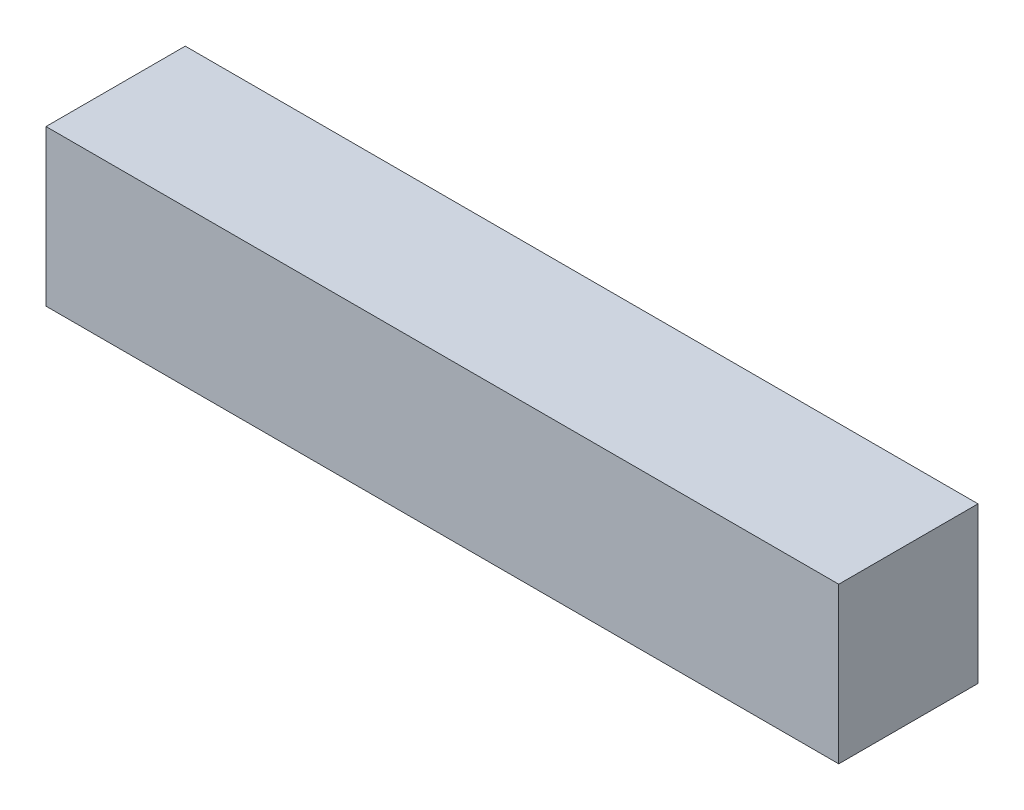
ISO-10303-21;
HEADER;
FILE_DESCRIPTION(('STEP AP214'),'2;1');
FILE_NAME('part.step','',(''),(''),'','','');
FILE_SCHEMA(('AUTOMOTIVE_DESIGN { 1 0 10303 214 1 1 1 1 }'));
ENDSEC;
DATA;
#1=APPLICATION_CONTEXT('core data for automotive mechanical design processes');
#2=APPLICATION_PROTOCOL_DEFINITION('international standard','automotive_design',2000,#1);
#3=PRODUCT_CONTEXT('',#1,'mechanical');
#4=PRODUCT('Part','Part','',(#3));
#5=PRODUCT_RELATED_PRODUCT_CATEGORY('part','',(#4));
#6=PRODUCT_DEFINITION_FORMATION('','',#4);
#7=PRODUCT_DEFINITION_CONTEXT('part definition',#1,'design');
#8=PRODUCT_DEFINITION('design','',#6,#7);
#9=PRODUCT_DEFINITION_SHAPE('','',#8);
#10=(LENGTH_UNIT() NAMED_UNIT(*) SI_UNIT(.MILLI.,.METRE.));
#11=(NAMED_UNIT(*) PLANE_ANGLE_UNIT() SI_UNIT($,.RADIAN.));
#12=(NAMED_UNIT(*) SI_UNIT($,.STERADIAN.) SOLID_ANGLE_UNIT());
#13=UNCERTAINTY_MEASURE_WITH_UNIT(LENGTH_MEASURE(1.E-05),#10,'distance_accuracy_value','');
#14=(GEOMETRIC_REPRESENTATION_CONTEXT(3) GLOBAL_UNCERTAINTY_ASSIGNED_CONTEXT((#13)) GLOBAL_UNIT_ASSIGNED_CONTEXT((#10,
#11,#12)) REPRESENTATION_CONTEXT('',''));
#15=CARTESIAN_POINT('',(0.,0.,0.));
#16=DIRECTION('',(0.,0.,1.));
#17=DIRECTION('',(1.,0.,0.));
#18=AXIS2_PLACEMENT_3D('',#15,#16,#17);
#19=CARTESIAN_POINT('',(-50.2625878459403,20.,-2.71305946588129));
#20=DIRECTION('',(0.,0.,-1.));
#21=DIRECTION('',(-1.,0.,0.));
#22=AXIS2_PLACEMENT_3D('',#19,#20,#21);
#23=PLANE('',#22);
#24=DIRECTION('',(1.,0.,0.));
#25=VECTOR('',#24,1.);
#26=CARTESIAN_POINT('',(-50.2625878459403,0.,-2.71305946588129));
#27=LINE('',#26,#25);
#28=CARTESIAN_POINT('',(-50.2625878459403,0.,-2.71305946588129));
#29=VERTEX_POINT('',#28);
#30=CARTESIAN_POINT('',(51.6374121540597,0.,-2.71305946588129));
#31=VERTEX_POINT('',#30);
#32=EDGE_CURVE('E98',#29,#31,#27,.T.);
#33=ORIENTED_EDGE('',*,*,#32,.F.);
#34=DIRECTION('',(0.,-1.,0.));
#35=VECTOR('',#34,1.);
#36=CARTESIAN_POINT('',(-50.2625878459403,20.,-2.71305946588129));
#37=LINE('',#36,#35);
#38=CARTESIAN_POINT('',(-50.2625878459403,20.,-2.71305946588129));
#39=VERTEX_POINT('',#38);
#40=EDGE_CURVE('E11',#39,#29,#37,.T.);
#41=ORIENTED_EDGE('',*,*,#40,.F.);
#42=DIRECTION('',(1.,0.,0.));
#43=VECTOR('',#42,1.);
#44=CARTESIAN_POINT('',(-50.2625878459403,20.,-2.71305946588129));
#45=LINE('',#44,#43);
#46=CARTESIAN_POINT('',(51.6374121540597,20.,-2.71305946588129));
#47=VERTEX_POINT('',#46);
#48=EDGE_CURVE('E93',#39,#47,#45,.T.);
#49=ORIENTED_EDGE('',*,*,#48,.T.);
#50=DIRECTION('',(0.,-1.,0.));
#51=VECTOR('',#50,1.);
#52=CARTESIAN_POINT('',(51.6374121540597,20.,-2.71305946588129));
#53=LINE('',#52,#51);
#54=EDGE_CURVE('E36',#47,#31,#53,.T.);
#55=ORIENTED_EDGE('',*,*,#54,.T.);
#56=EDGE_LOOP('',(#33,#41,#49,#55));
#57=FACE_BOUND('',#56,.T.);
#58=ADVANCED_FACE('F33',(#57),#23,.T.);
#59=CARTESIAN_POINT('',(-50.2625878459403,20.,-2.71305946588129));
#60=DIRECTION('',(1.,0.,0.));
#61=DIRECTION('',(0.,0.,-1.));
#62=AXIS2_PLACEMENT_3D('',#59,#60,#61);
#63=PLANE('',#62);
#64=DIRECTION('',(0.,0.,1.));
#65=VECTOR('',#64,1.);
#66=CARTESIAN_POINT('',(-50.2625878459403,0.,-2.71305946588129));
#67=LINE('',#66,#65);
#68=CARTESIAN_POINT('',(-50.2625878459403,0.,15.1869405341187));
#69=VERTEX_POINT('',#68);
#70=EDGE_CURVE('E66',#29,#69,#67,.T.);
#71=ORIENTED_EDGE('',*,*,#70,.T.);
#72=DIRECTION('',(0.,-1.,0.));
#73=VECTOR('',#72,1.);
#74=CARTESIAN_POINT('',(-50.2625878459403,20.,15.1869405341187));
#75=LINE('',#74,#73);
#76=CARTESIAN_POINT('',(-50.2625878459403,20.,15.1869405341187));
#77=VERTEX_POINT('',#76);
#78=EDGE_CURVE('E42',#77,#69,#75,.T.);
#79=ORIENTED_EDGE('',*,*,#78,.F.);
#80=DIRECTION('',(0.,0.,1.));
#81=VECTOR('',#80,1.);
#82=CARTESIAN_POINT('',(-50.2625878459403,20.,-2.71305946588129));
#83=LINE('',#82,#81);
#84=EDGE_CURVE('E83',#39,#77,#83,.T.);
#85=ORIENTED_EDGE('',*,*,#84,.F.);
#86=ORIENTED_EDGE('',*,*,#40,.T.);
#87=EDGE_LOOP('',(#71,#79,#85,#86));
#88=FACE_BOUND('',#87,.T.);
#89=ADVANCED_FACE('F108',(#88),#63,.F.);
#90=CARTESIAN_POINT('',(-50.2625878459403,20.,15.1869405341187));
#91=DIRECTION('',(0.,0.,-1.));
#92=DIRECTION('',(-1.,0.,0.));
#93=AXIS2_PLACEMENT_3D('',#90,#91,#92);
#94=PLANE('',#93);
#95=DIRECTION('',(1.,0.,0.));
#96=VECTOR('',#95,1.);
#97=CARTESIAN_POINT('',(-50.2625878459403,0.,15.1869405341187));
#98=LINE('',#97,#96);
#99=CARTESIAN_POINT('',(51.6374121540597,0.,15.1869405341187));
#100=VERTEX_POINT('',#99);
#101=EDGE_CURVE('E90',#69,#100,#98,.T.);
#102=ORIENTED_EDGE('',*,*,#101,.T.);
#103=DIRECTION('',(0.,-1.,0.));
#104=VECTOR('',#103,1.);
#105=CARTESIAN_POINT('',(51.6374121540597,20.,15.1869405341187));
#106=LINE('',#105,#104);
#107=CARTESIAN_POINT('',(51.6374121540597,20.,15.1869405341187));
#108=VERTEX_POINT('',#107);
#109=EDGE_CURVE('E87',#108,#100,#106,.T.);
#110=ORIENTED_EDGE('',*,*,#109,.F.);
#111=DIRECTION('',(1.,0.,0.));
#112=VECTOR('',#111,1.);
#113=CARTESIAN_POINT('',(-50.2625878459403,20.,15.1869405341187));
#114=LINE('',#113,#112);
#115=EDGE_CURVE('E78',#77,#108,#114,.T.);
#116=ORIENTED_EDGE('',*,*,#115,.F.);
#117=ORIENTED_EDGE('',*,*,#78,.T.);
#118=EDGE_LOOP('',(#102,#110,#116,#117));
#119=FACE_BOUND('',#118,.T.);
#120=ADVANCED_FACE('F88',(#119),#94,.F.);
#121=CARTESIAN_POINT('',(51.6374121540597,20.,-2.71305946588129));
#122=DIRECTION('',(1.,0.,0.));
#123=DIRECTION('',(0.,0.,-1.));
#124=AXIS2_PLACEMENT_3D('',#121,#122,#123);
#125=PLANE('',#124);
#126=DIRECTION('',(0.,0.,1.));
#127=VECTOR('',#126,1.);
#128=CARTESIAN_POINT('',(51.6374121540597,0.,-2.71305946588129));
#129=LINE('',#128,#127);
#130=EDGE_CURVE('E101',#31,#100,#129,.T.);
#131=ORIENTED_EDGE('',*,*,#130,.F.);
#132=ORIENTED_EDGE('',*,*,#54,.F.);
#133=DIRECTION('',(0.,0.,1.));
#134=VECTOR('',#133,1.);
#135=CARTESIAN_POINT('',(51.6374121540597,20.,-2.71305946588129));
#136=LINE('',#135,#134);
#137=EDGE_CURVE('E82',#47,#108,#136,.T.);
#138=ORIENTED_EDGE('',*,*,#137,.T.);
#139=ORIENTED_EDGE('',*,*,#109,.T.);
#140=EDGE_LOOP('',(#131,#132,#138,#139));
#141=FACE_BOUND('',#140,.T.);
#142=ADVANCED_FACE('F92',(#141),#125,.T.);
#143=CARTESIAN_POINT('',(0.,20.,0.));
#144=DIRECTION('',(0.,-1.,0.));
#145=DIRECTION('',(0.,0.,-1.));
#146=AXIS2_PLACEMENT_3D('',#143,#144,#145);
#147=PLANE('',#146);
#148=ORIENTED_EDGE('',*,*,#48,.F.);
#149=ORIENTED_EDGE('',*,*,#84,.T.);
#150=ORIENTED_EDGE('',*,*,#115,.T.);
#151=ORIENTED_EDGE('',*,*,#137,.F.);
#152=EDGE_LOOP('',(#148,#149,#150,#151));
#153=FACE_BOUND('',#152,.T.);
#154=ADVANCED_FACE('F81',(#153),#147,.F.);
#155=CARTESIAN_POINT('',(0.,0.,0.));
#156=DIRECTION('',(0.,-1.,0.));
#157=DIRECTION('',(0.,0.,-1.));
#158=AXIS2_PLACEMENT_3D('',#155,#156,#157);
#159=PLANE('',#158);
#160=ORIENTED_EDGE('',*,*,#32,.T.);
#161=ORIENTED_EDGE('',*,*,#130,.T.);
#162=ORIENTED_EDGE('',*,*,#101,.F.);
#163=ORIENTED_EDGE('',*,*,#70,.F.);
#164=EDGE_LOOP('',(#160,#161,#162,#163));
#165=FACE_BOUND('',#164,.T.);
#166=ADVANCED_FACE('F106',(#165),#159,.T.);
#167=CLOSED_SHELL('',(#58,#89,#120,#142,#154,#166));
#168=MANIFOLD_SOLID_BREP('B2',#167);
#169=ADVANCED_BREP_SHAPE_REPRESENTATION('',(#18,#168),#14);
#170=SHAPE_DEFINITION_REPRESENTATION(#9,#169);
ENDSEC;
END-ISO-10303-21;
